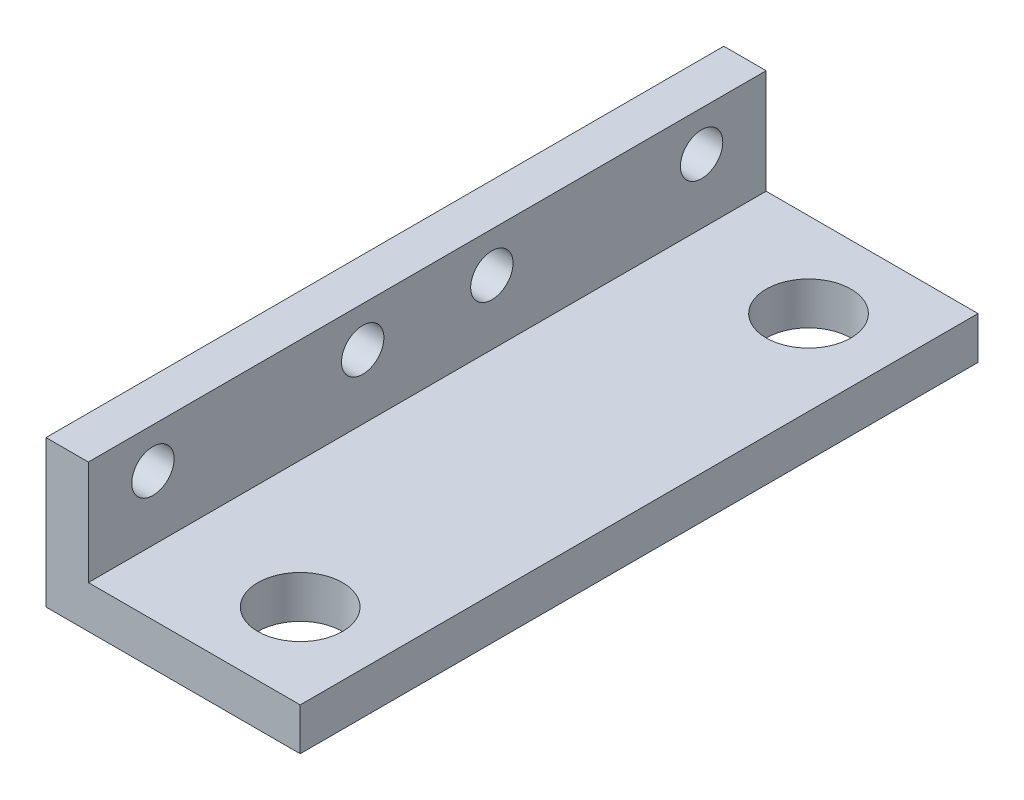
ISO-10303-21;
HEADER;
FILE_DESCRIPTION(('STEP AP214'),'2;1');
FILE_NAME('part.step','',(''),(''),'','','');
FILE_SCHEMA(('AUTOMOTIVE_DESIGN { 1 0 10303 214 1 1 1 1 }'));
ENDSEC;
DATA;
#1=APPLICATION_CONTEXT('core data for automotive mechanical design processes');
#2=APPLICATION_PROTOCOL_DEFINITION('international standard','automotive_design',2000,#1);
#3=PRODUCT_CONTEXT('',#1,'mechanical');
#4=PRODUCT('Part','Part','',(#3));
#5=PRODUCT_RELATED_PRODUCT_CATEGORY('part','',(#4));
#6=PRODUCT_DEFINITION_FORMATION('','',#4);
#7=PRODUCT_DEFINITION_CONTEXT('part definition',#1,'design');
#8=PRODUCT_DEFINITION('design','',#6,#7);
#9=PRODUCT_DEFINITION_SHAPE('','',#8);
#10=(LENGTH_UNIT() NAMED_UNIT(*) SI_UNIT(.MILLI.,.METRE.));
#11=(NAMED_UNIT(*) PLANE_ANGLE_UNIT() SI_UNIT($,.RADIAN.));
#12=(NAMED_UNIT(*) SI_UNIT($,.STERADIAN.) SOLID_ANGLE_UNIT());
#13=UNCERTAINTY_MEASURE_WITH_UNIT(LENGTH_MEASURE(1.E-05),#10,'distance_accuracy_value','');
#14=(GEOMETRIC_REPRESENTATION_CONTEXT(3) GLOBAL_UNCERTAINTY_ASSIGNED_CONTEXT((#13)) GLOBAL_UNIT_ASSIGNED_CONTEXT((#10,
#11,#12)) REPRESENTATION_CONTEXT('',''));
#15=CARTESIAN_POINT('',(0.,0.,0.));
#16=DIRECTION('',(0.,0.,1.));
#17=DIRECTION('',(1.,0.,0.));
#18=AXIS2_PLACEMENT_3D('',#15,#16,#17);
#19=CARTESIAN_POINT('',(19.05,0.,50.8));
#20=DIRECTION('',(0.,1.,0.));
#21=DIRECTION('',(-1.,0.,0.));
#22=AXIS2_PLACEMENT_3D('',#19,#20,#21);
#23=PLANE('',#22);
#24=CARTESIAN_POINT('',(12.7,0.,6.34999999999999));
#25=DIRECTION('',(0.,1.,0.));
#26=DIRECTION('',(-1.,0.,0.));
#27=AXIS2_PLACEMENT_3D('',#24,#25,#26);
#28=CIRCLE('',#27,3.175);
#29=CARTESIAN_POINT('',(9.525,0.,6.34999999999999));
#30=VERTEX_POINT('',#29);
#31=EDGE_CURVE('E177',#30,#30,#28,.T.);
#32=ORIENTED_EDGE('',*,*,#31,.T.);
#33=EDGE_LOOP('',(#32));
#34=FACE_BOUND('',#33,.T.);
#35=CARTESIAN_POINT('',(12.7,0.,44.45));
#36=DIRECTION('',(0.,1.,0.));
#37=DIRECTION('',(-1.,0.,0.));
#38=AXIS2_PLACEMENT_3D('',#35,#36,#37);
#39=CIRCLE('',#38,3.175);
#40=CARTESIAN_POINT('',(9.52500000000001,0.,44.45));
#41=VERTEX_POINT('',#40);
#42=EDGE_CURVE('E181',#41,#41,#39,.T.);
#43=ORIENTED_EDGE('',*,*,#42,.T.);
#44=EDGE_LOOP('',(#43));
#45=FACE_BOUND('',#44,.T.);
#46=DIRECTION('',(1.,0.,0.));
#47=VECTOR('',#46,1.);
#48=CARTESIAN_POINT('',(19.05,0.,0.));
#49=LINE('',#48,#47);
#50=CARTESIAN_POINT('',(0.,0.,0.));
#51=VERTEX_POINT('',#50);
#52=CARTESIAN_POINT('',(19.05,0.,0.));
#53=VERTEX_POINT('',#52);
#54=EDGE_CURVE('E119',#51,#53,#49,.T.);
#55=ORIENTED_EDGE('',*,*,#54,.T.);
#56=DIRECTION('',(0.,0.,-1.));
#57=VECTOR('',#56,1.);
#58=CARTESIAN_POINT('',(19.05,0.,50.8));
#59=LINE('',#58,#57);
#60=CARTESIAN_POINT('',(19.05,0.,50.8));
#61=VERTEX_POINT('',#60);
#62=EDGE_CURVE('E11',#61,#53,#59,.T.);
#63=ORIENTED_EDGE('',*,*,#62,.F.);
#64=DIRECTION('',(1.,0.,0.));
#65=VECTOR('',#64,1.);
#66=CARTESIAN_POINT('',(19.05,0.,50.8));
#67=LINE('',#66,#65);
#68=CARTESIAN_POINT('',(0.,0.,50.8));
#69=VERTEX_POINT('',#68);
#70=EDGE_CURVE('E129',#69,#61,#67,.T.);
#71=ORIENTED_EDGE('',*,*,#70,.F.);
#72=DIRECTION('',(0.,0.,-1.));
#73=VECTOR('',#72,1.);
#74=CARTESIAN_POINT('',(0.,0.,50.8));
#75=LINE('',#74,#73);
#76=EDGE_CURVE('E115',#69,#51,#75,.T.);
#77=ORIENTED_EDGE('',*,*,#76,.T.);
#78=EDGE_LOOP('',(#55,#63,#71,#77));
#79=FACE_BOUND('',#78,.T.);
#80=ADVANCED_FACE('F33',(#34,#45,#79),#23,.F.);
#81=CARTESIAN_POINT('',(19.05,3.175,50.8));
#82=DIRECTION('',(-1.,0.,0.));
#83=DIRECTION('',(0.,0.,1.));
#84=AXIS2_PLACEMENT_3D('',#81,#82,#83);
#85=PLANE('',#84);
#86=DIRECTION('',(0.,1.,0.));
#87=VECTOR('',#86,1.);
#88=CARTESIAN_POINT('',(19.05,3.175,0.));
#89=LINE('',#88,#87);
#90=CARTESIAN_POINT('',(19.05,3.175,0.));
#91=VERTEX_POINT('',#90);
#92=EDGE_CURVE('E122',#53,#91,#89,.T.);
#93=ORIENTED_EDGE('',*,*,#92,.T.);
#94=DIRECTION('',(0.,0.,-1.));
#95=VECTOR('',#94,1.);
#96=CARTESIAN_POINT('',(19.05,3.175,50.8));
#97=LINE('',#96,#95);
#98=CARTESIAN_POINT('',(19.05,3.175,50.8));
#99=VERTEX_POINT('',#98);
#100=EDGE_CURVE('E42',#99,#91,#97,.T.);
#101=ORIENTED_EDGE('',*,*,#100,.F.);
#102=DIRECTION('',(0.,1.,0.));
#103=VECTOR('',#102,1.);
#104=CARTESIAN_POINT('',(19.05,3.175,50.8));
#105=LINE('',#104,#103);
#106=EDGE_CURVE('E88',#61,#99,#105,.T.);
#107=ORIENTED_EDGE('',*,*,#106,.F.);
#108=ORIENTED_EDGE('',*,*,#62,.T.);
#109=EDGE_LOOP('',(#93,#101,#107,#108));
#110=FACE_BOUND('',#109,.T.);
#111=ADVANCED_FACE('F168',(#110),#85,.F.);
#112=CARTESIAN_POINT('',(3.175,3.175,50.8));
#113=DIRECTION('',(0.,-1.,0.));
#114=DIRECTION('',(1.,0.,0.));
#115=AXIS2_PLACEMENT_3D('',#112,#113,#114);
#116=PLANE('',#115);
#117=CARTESIAN_POINT('',(12.7,3.175,6.34999999999999));
#118=DIRECTION('',(0.,1.,0.));
#119=DIRECTION('',(0.,0.,1.));
#120=AXIS2_PLACEMENT_3D('',#117,#118,#119);
#121=CIRCLE('',#120,3.175);
#122=CARTESIAN_POINT('',(12.7,3.175,9.525));
#123=VERTEX_POINT('',#122);
#124=EDGE_CURVE('E204',#123,#123,#121,.T.);
#125=ORIENTED_EDGE('',*,*,#124,.F.);
#126=EDGE_LOOP('',(#125));
#127=FACE_BOUND('',#126,.T.);
#128=CARTESIAN_POINT('',(12.7,3.175,44.45));
#129=DIRECTION('',(0.,1.,0.));
#130=DIRECTION('',(0.,0.,1.));
#131=AXIS2_PLACEMENT_3D('',#128,#129,#130);
#132=CIRCLE('',#131,3.175);
#133=CARTESIAN_POINT('',(12.7,3.175,47.625));
#134=VERTEX_POINT('',#133);
#135=EDGE_CURVE('E205',#134,#134,#132,.T.);
#136=ORIENTED_EDGE('',*,*,#135,.F.);
#137=EDGE_LOOP('',(#136));
#138=FACE_BOUND('',#137,.T.);
#139=DIRECTION('',(-1.,0.,0.));
#140=VECTOR('',#139,1.);
#141=CARTESIAN_POINT('',(3.175,3.175,0.));
#142=LINE('',#141,#140);
#143=CARTESIAN_POINT('',(3.175,3.175,0.));
#144=VERTEX_POINT('',#143);
#145=EDGE_CURVE('E124',#91,#144,#142,.T.);
#146=ORIENTED_EDGE('',*,*,#145,.T.);
#147=DIRECTION('',(0.,0.,-1.));
#148=VECTOR('',#147,1.);
#149=CARTESIAN_POINT('',(3.175,3.175,50.8));
#150=LINE('',#149,#148);
#151=CARTESIAN_POINT('',(3.175,3.175,50.8));
#152=VERTEX_POINT('',#151);
#153=EDGE_CURVE('E110',#152,#144,#150,.T.);
#154=ORIENTED_EDGE('',*,*,#153,.F.);
#155=DIRECTION('',(-1.,0.,0.));
#156=VECTOR('',#155,1.);
#157=CARTESIAN_POINT('',(3.175,3.175,50.8));
#158=LINE('',#157,#156);
#159=EDGE_CURVE('E101',#99,#152,#158,.T.);
#160=ORIENTED_EDGE('',*,*,#159,.F.);
#161=ORIENTED_EDGE('',*,*,#100,.T.);
#162=EDGE_LOOP('',(#146,#154,#160,#161));
#163=FACE_BOUND('',#162,.T.);
#164=ADVANCED_FACE('F173',(#127,#138,#163),#116,.F.);
#165=CARTESIAN_POINT('',(3.175,11.,50.8));
#166=DIRECTION('',(-1.,0.,0.));
#167=DIRECTION('',(0.,-1.,0.));
#168=AXIS2_PLACEMENT_3D('',#165,#166,#167);
#169=PLANE('',#168);
#170=CARTESIAN_POINT('',(3.175,8.,45.96));
#171=DIRECTION('',(1.,0.,0.));
#172=DIRECTION('',(0.,1.,0.));
#173=AXIS2_PLACEMENT_3D('',#170,#171,#172);
#174=CIRCLE('',#173,1.5875);
#175=CARTESIAN_POINT('',(3.175,9.5875,45.96));
#176=VERTEX_POINT('',#175);
#177=EDGE_CURVE('E139',#176,#176,#174,.T.);
#178=ORIENTED_EDGE('',*,*,#177,.F.);
#179=EDGE_LOOP('',(#178));
#180=FACE_BOUND('',#179,.T.);
#181=CARTESIAN_POINT('',(3.175,8.,30.24));
#182=DIRECTION('',(1.,0.,0.));
#183=DIRECTION('',(0.,1.,0.));
#184=AXIS2_PLACEMENT_3D('',#181,#182,#183);
#185=CIRCLE('',#184,1.5875);
#186=CARTESIAN_POINT('',(3.175,9.5875,30.24));
#187=VERTEX_POINT('',#186);
#188=EDGE_CURVE('E198',#187,#187,#185,.T.);
#189=ORIENTED_EDGE('',*,*,#188,.F.);
#190=EDGE_LOOP('',(#189));
#191=FACE_BOUND('',#190,.T.);
#192=CARTESIAN_POINT('',(3.175,8.,20.56));
#193=DIRECTION('',(1.,0.,0.));
#194=DIRECTION('',(0.,1.,0.));
#195=AXIS2_PLACEMENT_3D('',#192,#193,#194);
#196=CIRCLE('',#195,1.5875);
#197=CARTESIAN_POINT('',(3.175,9.5875,20.56));
#198=VERTEX_POINT('',#197);
#199=EDGE_CURVE('E195',#198,#198,#196,.T.);
#200=ORIENTED_EDGE('',*,*,#199,.F.);
#201=EDGE_LOOP('',(#200));
#202=FACE_BOUND('',#201,.T.);
#203=CARTESIAN_POINT('',(3.175,8.,4.84));
#204=DIRECTION('',(1.,0.,0.));
#205=DIRECTION('',(0.,1.,0.));
#206=AXIS2_PLACEMENT_3D('',#203,#204,#205);
#207=CIRCLE('',#206,1.5875);
#208=CARTESIAN_POINT('',(3.175,9.5875,4.84));
#209=VERTEX_POINT('',#208);
#210=EDGE_CURVE('E192',#209,#209,#207,.T.);
#211=ORIENTED_EDGE('',*,*,#210,.F.);
#212=EDGE_LOOP('',(#211));
#213=FACE_BOUND('',#212,.T.);
#214=DIRECTION('',(0.,1.,0.));
#215=VECTOR('',#214,1.);
#216=CARTESIAN_POINT('',(3.175,11.,0.));
#217=LINE('',#216,#215);
#218=CARTESIAN_POINT('',(3.175,11.,0.));
#219=VERTEX_POINT('',#218);
#220=EDGE_CURVE('E109',#144,#219,#217,.T.);
#221=ORIENTED_EDGE('',*,*,#220,.T.);
#222=DIRECTION('',(0.,0.,-1.));
#223=VECTOR('',#222,1.);
#224=CARTESIAN_POINT('',(3.175,11.,50.8));
#225=LINE('',#224,#223);
#226=CARTESIAN_POINT('',(3.175,11.,50.8));
#227=VERTEX_POINT('',#226);
#228=EDGE_CURVE('E106',#227,#219,#225,.T.);
#229=ORIENTED_EDGE('',*,*,#228,.F.);
#230=DIRECTION('',(0.,1.,0.));
#231=VECTOR('',#230,1.);
#232=CARTESIAN_POINT('',(3.175,11.,50.8));
#233=LINE('',#232,#231);
#234=EDGE_CURVE('E95',#152,#227,#233,.T.);
#235=ORIENTED_EDGE('',*,*,#234,.F.);
#236=ORIENTED_EDGE('',*,*,#153,.T.);
#237=EDGE_LOOP('',(#221,#229,#235,#236));
#238=FACE_BOUND('',#237,.T.);
#239=ADVANCED_FACE('F107',(#180,#191,#202,#213,#238),#169,.F.);
#240=CARTESIAN_POINT('',(0.,11.,50.8));
#241=DIRECTION('',(0.,-1.,0.));
#242=DIRECTION('',(0.,0.,-1.));
#243=AXIS2_PLACEMENT_3D('',#240,#241,#242);
#244=PLANE('',#243);
#245=DIRECTION('',(-1.,0.,0.));
#246=VECTOR('',#245,1.);
#247=CARTESIAN_POINT('',(0.,11.,0.));
#248=LINE('',#247,#246);
#249=CARTESIAN_POINT('',(0.,11.,0.));
#250=VERTEX_POINT('',#249);
#251=EDGE_CURVE('E74',#219,#250,#248,.T.);
#252=ORIENTED_EDGE('',*,*,#251,.T.);
#253=DIRECTION('',(0.,0.,-1.));
#254=VECTOR('',#253,1.);
#255=CARTESIAN_POINT('',(0.,11.,50.8));
#256=LINE('',#255,#254);
#257=CARTESIAN_POINT('',(0.,11.,50.8));
#258=VERTEX_POINT('',#257);
#259=EDGE_CURVE('E111',#258,#250,#256,.T.);
#260=ORIENTED_EDGE('',*,*,#259,.F.);
#261=DIRECTION('',(-1.,0.,0.));
#262=VECTOR('',#261,1.);
#263=CARTESIAN_POINT('',(0.,11.,50.8));
#264=LINE('',#263,#262);
#265=EDGE_CURVE('E99',#227,#258,#264,.T.);
#266=ORIENTED_EDGE('',*,*,#265,.F.);
#267=ORIENTED_EDGE('',*,*,#228,.T.);
#268=EDGE_LOOP('',(#252,#260,#266,#267));
#269=FACE_BOUND('',#268,.T.);
#270=ADVANCED_FACE('F113',(#269),#244,.F.);
#271=CARTESIAN_POINT('',(0.,0.,50.8));
#272=DIRECTION('',(1.,0.,0.));
#273=DIRECTION('',(0.,0.,-1.));
#274=AXIS2_PLACEMENT_3D('',#271,#272,#273);
#275=PLANE('',#274);
#276=CARTESIAN_POINT('',(0.,8.,45.96));
#277=DIRECTION('',(1.,0.,0.));
#278=DIRECTION('',(0.,0.,-1.));
#279=AXIS2_PLACEMENT_3D('',#276,#277,#278);
#280=CIRCLE('',#279,1.5875);
#281=CARTESIAN_POINT('',(0.,8.,44.3725));
#282=VERTEX_POINT('',#281);
#283=EDGE_CURVE('E36',#282,#282,#280,.T.);
#284=ORIENTED_EDGE('',*,*,#283,.T.);
#285=EDGE_LOOP('',(#284));
#286=FACE_BOUND('',#285,.T.);
#287=CARTESIAN_POINT('',(0.,8.,30.24));
#288=DIRECTION('',(1.,0.,0.));
#289=DIRECTION('',(0.,0.,-1.));
#290=AXIS2_PLACEMENT_3D('',#287,#288,#289);
#291=CIRCLE('',#290,1.5875);
#292=CARTESIAN_POINT('',(0.,8.,28.6525));
#293=VERTEX_POINT('',#292);
#294=EDGE_CURVE('E141',#293,#293,#291,.T.);
#295=ORIENTED_EDGE('',*,*,#294,.T.);
#296=EDGE_LOOP('',(#295));
#297=FACE_BOUND('',#296,.T.);
#298=CARTESIAN_POINT('',(0.,8.,20.56));
#299=DIRECTION('',(1.,0.,0.));
#300=DIRECTION('',(0.,0.,-1.));
#301=AXIS2_PLACEMENT_3D('',#298,#299,#300);
#302=CIRCLE('',#301,1.5875);
#303=CARTESIAN_POINT('',(0.,8.,18.9725));
#304=VERTEX_POINT('',#303);
#305=EDGE_CURVE('E138',#304,#304,#302,.T.);
#306=ORIENTED_EDGE('',*,*,#305,.T.);
#307=EDGE_LOOP('',(#306));
#308=FACE_BOUND('',#307,.T.);
#309=CARTESIAN_POINT('',(0.,8.,4.84));
#310=DIRECTION('',(1.,0.,0.));
#311=DIRECTION('',(0.,0.,-1.));
#312=AXIS2_PLACEMENT_3D('',#309,#310,#311);
#313=CIRCLE('',#312,1.5875);
#314=CARTESIAN_POINT('',(0.,8.,3.2525));
#315=VERTEX_POINT('',#314);
#316=EDGE_CURVE('E135',#315,#315,#313,.T.);
#317=ORIENTED_EDGE('',*,*,#316,.T.);
#318=EDGE_LOOP('',(#317));
#319=FACE_BOUND('',#318,.T.);
#320=DIRECTION('',(0.,-1.,0.));
#321=VECTOR('',#320,1.);
#322=CARTESIAN_POINT('',(0.,0.,0.));
#323=LINE('',#322,#321);
#324=EDGE_CURVE('E80',#250,#51,#323,.T.);
#325=ORIENTED_EDGE('',*,*,#324,.T.);
#326=ORIENTED_EDGE('',*,*,#76,.F.);
#327=DIRECTION('',(0.,-1.,0.));
#328=VECTOR('',#327,1.);
#329=CARTESIAN_POINT('',(0.,0.,50.8));
#330=LINE('',#329,#328);
#331=EDGE_CURVE('E51',#258,#69,#330,.T.);
#332=ORIENTED_EDGE('',*,*,#331,.F.);
#333=ORIENTED_EDGE('',*,*,#259,.T.);
#334=EDGE_LOOP('',(#325,#326,#332,#333));
#335=FACE_BOUND('',#334,.T.);
#336=ADVANCED_FACE('F148',(#286,#297,#308,#319,#335),#275,.F.);
#337=CARTESIAN_POINT('',(0.,0.,50.8));
#338=DIRECTION('',(0.,0.,-1.));
#339=DIRECTION('',(-1.,0.,0.));
#340=AXIS2_PLACEMENT_3D('',#337,#338,#339);
#341=PLANE('',#340);
#342=ORIENTED_EDGE('',*,*,#70,.T.);
#343=ORIENTED_EDGE('',*,*,#106,.T.);
#344=ORIENTED_EDGE('',*,*,#159,.T.);
#345=ORIENTED_EDGE('',*,*,#234,.T.);
#346=ORIENTED_EDGE('',*,*,#265,.T.);
#347=ORIENTED_EDGE('',*,*,#331,.T.);
#348=EDGE_LOOP('',(#342,#343,#344,#345,#346,#347));
#349=FACE_BOUND('',#348,.T.);
#350=ADVANCED_FACE('F97',(#349),#341,.F.);
#351=CARTESIAN_POINT('',(0.,0.,0.));
#352=DIRECTION('',(0.,0.,-1.));
#353=DIRECTION('',(-1.,0.,0.));
#354=AXIS2_PLACEMENT_3D('',#351,#352,#353);
#355=PLANE('',#354);
#356=ORIENTED_EDGE('',*,*,#54,.F.);
#357=ORIENTED_EDGE('',*,*,#324,.F.);
#358=ORIENTED_EDGE('',*,*,#251,.F.);
#359=ORIENTED_EDGE('',*,*,#220,.F.);
#360=ORIENTED_EDGE('',*,*,#145,.F.);
#361=ORIENTED_EDGE('',*,*,#92,.F.);
#362=EDGE_LOOP('',(#356,#357,#358,#359,#360,#361));
#363=FACE_BOUND('',#362,.T.);
#364=ADVANCED_FACE('F186',(#363),#355,.T.);
#365=CARTESIAN_POINT('',(-6.825,8.,4.84));
#366=DIRECTION('',(1.,0.,0.));
#367=DIRECTION('',(0.,1.,0.));
#368=AXIS2_PLACEMENT_3D('',#365,#366,#367);
#369=CYLINDRICAL_SURFACE('',#368,1.5875);
#370=ORIENTED_EDGE('',*,*,#210,.T.);
#371=EDGE_LOOP('',(#370));
#372=FACE_BOUND('',#371,.T.);
#373=ORIENTED_EDGE('',*,*,#316,.F.);
#374=EDGE_LOOP('',(#373));
#375=FACE_BOUND('',#374,.T.);
#376=ADVANCED_FACE('F230',(#372,#375),#369,.F.);
#377=CARTESIAN_POINT('',(-6.825,8.,20.56));
#378=DIRECTION('',(1.,0.,0.));
#379=DIRECTION('',(0.,1.,0.));
#380=AXIS2_PLACEMENT_3D('',#377,#378,#379);
#381=CYLINDRICAL_SURFACE('',#380,1.5875);
#382=ORIENTED_EDGE('',*,*,#199,.T.);
#383=EDGE_LOOP('',(#382));
#384=FACE_BOUND('',#383,.T.);
#385=ORIENTED_EDGE('',*,*,#305,.F.);
#386=EDGE_LOOP('',(#385));
#387=FACE_BOUND('',#386,.T.);
#388=ADVANCED_FACE('F163',(#384,#387),#381,.F.);
#389=CARTESIAN_POINT('',(-6.825,7.99999999999999,30.24));
#390=DIRECTION('',(1.,0.,0.));
#391=DIRECTION('',(0.,1.,0.));
#392=AXIS2_PLACEMENT_3D('',#389,#390,#391);
#393=CYLINDRICAL_SURFACE('',#392,1.5875);
#394=ORIENTED_EDGE('',*,*,#188,.T.);
#395=EDGE_LOOP('',(#394));
#396=FACE_BOUND('',#395,.T.);
#397=ORIENTED_EDGE('',*,*,#294,.F.);
#398=EDGE_LOOP('',(#397));
#399=FACE_BOUND('',#398,.T.);
#400=ADVANCED_FACE('F153',(#396,#399),#393,.F.);
#401=CARTESIAN_POINT('',(-6.825,8.,45.96));
#402=DIRECTION('',(1.,0.,0.));
#403=DIRECTION('',(0.,1.,0.));
#404=AXIS2_PLACEMENT_3D('',#401,#402,#403);
#405=CYLINDRICAL_SURFACE('',#404,1.5875);
#406=ORIENTED_EDGE('',*,*,#177,.T.);
#407=EDGE_LOOP('',(#406));
#408=FACE_BOUND('',#407,.T.);
#409=ORIENTED_EDGE('',*,*,#283,.F.);
#410=EDGE_LOOP('',(#409));
#411=FACE_BOUND('',#410,.T.);
#412=ADVANCED_FACE('F150',(#408,#411),#405,.F.);
#413=CARTESIAN_POINT('',(12.7,-3.175,44.45));
#414=DIRECTION('',(0.,1.,0.));
#415=DIRECTION('',(0.,0.,1.));
#416=AXIS2_PLACEMENT_3D('',#413,#414,#415);
#417=CYLINDRICAL_SURFACE('',#416,3.175);
#418=ORIENTED_EDGE('',*,*,#135,.T.);
#419=EDGE_LOOP('',(#418));
#420=FACE_BOUND('',#419,.T.);
#421=ORIENTED_EDGE('',*,*,#42,.F.);
#422=EDGE_LOOP('',(#421));
#423=FACE_BOUND('',#422,.T.);
#424=ADVANCED_FACE('F152',(#420,#423),#417,.F.);
#425=CARTESIAN_POINT('',(12.7,-3.175,6.34999999999999));
#426=DIRECTION('',(0.,1.,0.));
#427=DIRECTION('',(0.,0.,1.));
#428=AXIS2_PLACEMENT_3D('',#425,#426,#427);
#429=CYLINDRICAL_SURFACE('',#428,3.175);
#430=ORIENTED_EDGE('',*,*,#124,.T.);
#431=EDGE_LOOP('',(#430));
#432=FACE_BOUND('',#431,.T.);
#433=ORIENTED_EDGE('',*,*,#31,.F.);
#434=EDGE_LOOP('',(#433));
#435=FACE_BOUND('',#434,.T.);
#436=ADVANCED_FACE('F160',(#432,#435),#429,.F.);
#437=CLOSED_SHELL('',(#80,#111,#164,#239,#270,#336,#350,#364,#376,#388,#400,#412,#424,#436));
#438=MANIFOLD_SOLID_BREP('B2',#437);
#439=ADVANCED_BREP_SHAPE_REPRESENTATION('',(#18,#438),#14);
#440=SHAPE_DEFINITION_REPRESENTATION(#9,#439);
ENDSEC;
END-ISO-10303-21;
